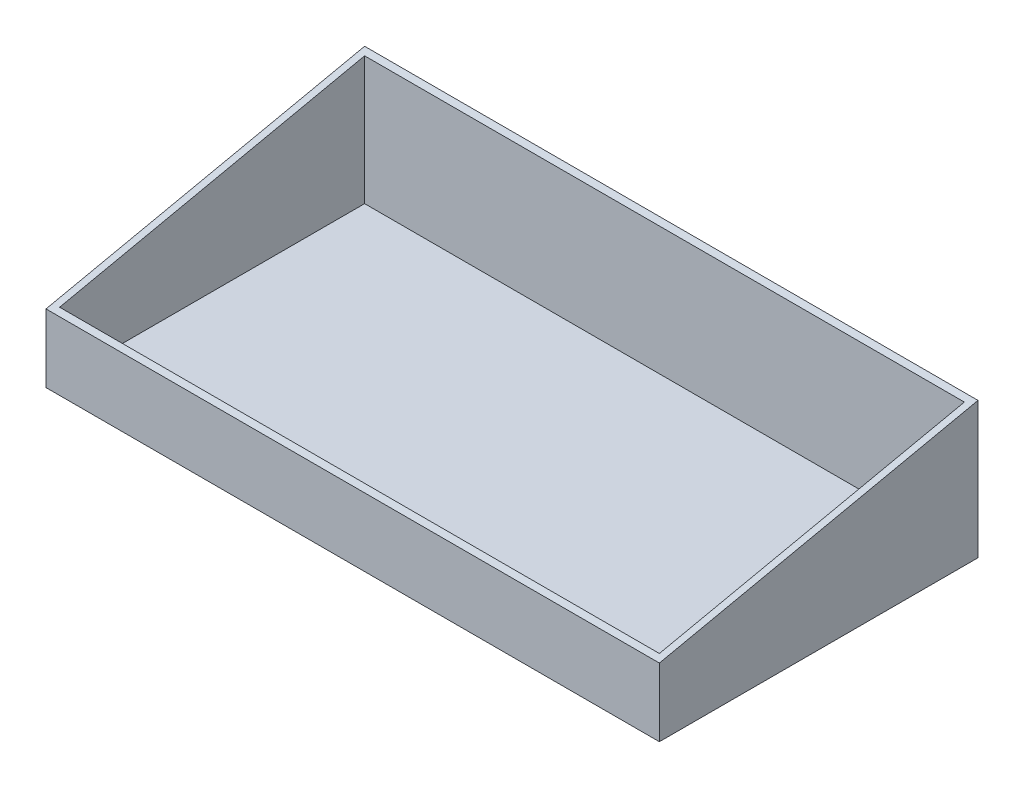
ISO-10303-21;
HEADER;
FILE_DESCRIPTION(('STEP AP214'),'2;1');
FILE_NAME('part.step','',(''),(''),'','','');
FILE_SCHEMA(('AUTOMOTIVE_DESIGN { 1 0 10303 214 1 1 1 1 }'));
ENDSEC;
DATA;
#1=APPLICATION_CONTEXT('core data for automotive mechanical design processes');
#2=APPLICATION_PROTOCOL_DEFINITION('international standard','automotive_design',2000,#1);
#3=PRODUCT_CONTEXT('',#1,'mechanical');
#4=PRODUCT('Part','Part','',(#3));
#5=PRODUCT_RELATED_PRODUCT_CATEGORY('part','',(#4));
#6=PRODUCT_DEFINITION_FORMATION('','',#4);
#7=PRODUCT_DEFINITION_CONTEXT('part definition',#1,'design');
#8=PRODUCT_DEFINITION('design','',#6,#7);
#9=PRODUCT_DEFINITION_SHAPE('','',#8);
#10=(LENGTH_UNIT() NAMED_UNIT(*) SI_UNIT(.MILLI.,.METRE.));
#11=(NAMED_UNIT(*) PLANE_ANGLE_UNIT() SI_UNIT($,.RADIAN.));
#12=(NAMED_UNIT(*) SI_UNIT($,.STERADIAN.) SOLID_ANGLE_UNIT());
#13=UNCERTAINTY_MEASURE_WITH_UNIT(LENGTH_MEASURE(1.E-05),#10,'distance_accuracy_value','');
#14=(GEOMETRIC_REPRESENTATION_CONTEXT(3) GLOBAL_UNCERTAINTY_ASSIGNED_CONTEXT((#13)) GLOBAL_UNIT_ASSIGNED_CONTEXT((#10,
#11,#12)) REPRESENTATION_CONTEXT('',''));
#15=CARTESIAN_POINT('',(0.,0.,0.));
#16=DIRECTION('',(0.,0.,1.));
#17=DIRECTION('',(1.,0.,0.));
#18=AXIS2_PLACEMENT_3D('',#15,#16,#17);
#19=CARTESIAN_POINT('',(180.,80.,-93.5));
#20=DIRECTION('',(-1.,0.,0.));
#21=DIRECTION('',(0.,0.,1.));
#22=AXIS2_PLACEMENT_3D('',#19,#20,#21);
#23=PLANE('',#22);
#24=DIRECTION('',(0.,-1.,0.));
#25=VECTOR('',#24,1.);
#26=CARTESIAN_POINT('',(180.,80.,-93.5));
#27=LINE('',#26,#25);
#28=CARTESIAN_POINT('',(180.,80.,-93.5));
#29=VERTEX_POINT('',#28);
#30=CARTESIAN_POINT('',(180.,0.,-93.5));
#31=VERTEX_POINT('',#30);
#32=EDGE_CURVE('E43',#29,#31,#27,.T.);
#33=ORIENTED_EDGE('',*,*,#32,.F.);
#34=DIRECTION('',(0.,-0.209171951911289,0.977878875185276));
#35=VECTOR('',#34,1.);
#36=CARTESIAN_POINT('',(180.,80.,-93.5000000000001));
#37=LINE('',#36,#35);
#38=CARTESIAN_POINT('',(180.,40.,93.4999999999999));
#39=VERTEX_POINT('',#38);
#40=EDGE_CURVE('E58',#29,#39,#37,.T.);
#41=ORIENTED_EDGE('',*,*,#40,.T.);
#42=DIRECTION('',(0.,-1.,0.));
#43=VECTOR('',#42,1.);
#44=CARTESIAN_POINT('',(180.,80.,93.5));
#45=LINE('',#44,#43);
#46=CARTESIAN_POINT('',(180.,0.,93.5));
#47=VERTEX_POINT('',#46);
#48=EDGE_CURVE('E89',#39,#47,#45,.T.);
#49=ORIENTED_EDGE('',*,*,#48,.T.);
#50=DIRECTION('',(0.,0.,-1.));
#51=VECTOR('',#50,1.);
#52=CARTESIAN_POINT('',(180.,0.,-93.5));
#53=LINE('',#52,#51);
#54=EDGE_CURVE('E101',#47,#31,#53,.T.);
#55=ORIENTED_EDGE('',*,*,#54,.T.);
#56=EDGE_LOOP('',(#33,#41,#49,#55));
#57=FACE_BOUND('',#56,.T.);
#58=ADVANCED_FACE('F36',(#57),#23,.F.);
#59=CARTESIAN_POINT('',(-180.,80.,-93.5));
#60=DIRECTION('',(0.,0.,1.));
#61=DIRECTION('',(1.,0.,0.));
#62=AXIS2_PLACEMENT_3D('',#59,#60,#61);
#63=PLANE('',#62);
#64=DIRECTION('',(-1.,0.,0.));
#65=VECTOR('',#64,1.);
#66=CARTESIAN_POINT('',(-180.,0.,-93.5));
#67=LINE('',#66,#65);
#68=CARTESIAN_POINT('',(-180.,0.,-93.5));
#69=VERTEX_POINT('',#68);
#70=EDGE_CURVE('E97',#31,#69,#67,.T.);
#71=ORIENTED_EDGE('',*,*,#70,.T.);
#72=DIRECTION('',(0.,-1.,0.));
#73=VECTOR('',#72,1.);
#74=CARTESIAN_POINT('',(-180.,80.,-93.5));
#75=LINE('',#74,#73);
#76=CARTESIAN_POINT('',(-180.,80.,-93.5));
#77=VERTEX_POINT('',#76);
#78=EDGE_CURVE('E88',#77,#69,#75,.T.);
#79=ORIENTED_EDGE('',*,*,#78,.F.);
#80=DIRECTION('',(-1.,0.,0.));
#81=VECTOR('',#80,1.);
#82=CARTESIAN_POINT('',(-180.,80.,-93.5));
#83=LINE('',#82,#81);
#84=EDGE_CURVE('E102',#29,#77,#83,.T.);
#85=ORIENTED_EDGE('',*,*,#84,.F.);
#86=ORIENTED_EDGE('',*,*,#32,.T.);
#87=EDGE_LOOP('',(#71,#79,#85,#86));
#88=FACE_BOUND('',#87,.T.);
#89=ADVANCED_FACE('F111',(#88),#63,.F.);
#90=CARTESIAN_POINT('',(-180.,80.,-93.5));
#91=DIRECTION('',(1.,0.,0.));
#92=DIRECTION('',(0.,0.,-1.));
#93=AXIS2_PLACEMENT_3D('',#90,#91,#92);
#94=PLANE('',#93);
#95=DIRECTION('',(0.,-1.,0.));
#96=VECTOR('',#95,1.);
#97=CARTESIAN_POINT('',(-180.,80.,93.5));
#98=LINE('',#97,#96);
#99=CARTESIAN_POINT('',(-180.,40.,93.5));
#100=VERTEX_POINT('',#99);
#101=CARTESIAN_POINT('',(-180.,0.,93.5));
#102=VERTEX_POINT('',#101);
#103=EDGE_CURVE('E77',#100,#102,#98,.T.);
#104=ORIENTED_EDGE('',*,*,#103,.F.);
#105=DIRECTION('',(0.,-0.209171951911289,0.977878875185276));
#106=VECTOR('',#105,1.);
#107=CARTESIAN_POINT('',(-180.,80.,-93.5));
#108=LINE('',#107,#106);
#109=EDGE_CURVE('E146',#77,#100,#108,.T.);
#110=ORIENTED_EDGE('',*,*,#109,.F.);
#111=ORIENTED_EDGE('',*,*,#78,.T.);
#112=DIRECTION('',(0.,0.,1.));
#113=VECTOR('',#112,1.);
#114=CARTESIAN_POINT('',(-180.,0.,-93.5));
#115=LINE('',#114,#113);
#116=EDGE_CURVE('E93',#69,#102,#115,.T.);
#117=ORIENTED_EDGE('',*,*,#116,.T.);
#118=EDGE_LOOP('',(#104,#110,#111,#117));
#119=FACE_BOUND('',#118,.T.);
#120=ADVANCED_FACE('F94',(#119),#94,.F.);
#121=CARTESIAN_POINT('',(-180.,80.,93.5));
#122=DIRECTION('',(0.,0.,-1.));
#123=DIRECTION('',(-1.,0.,0.));
#124=AXIS2_PLACEMENT_3D('',#121,#122,#123);
#125=PLANE('',#124);
#126=ORIENTED_EDGE('',*,*,#48,.F.);
#127=DIRECTION('',(-1.,0.,0.));
#128=VECTOR('',#127,1.);
#129=CARTESIAN_POINT('',(180.,40.,93.4999999999999));
#130=LINE('',#129,#128);
#131=EDGE_CURVE('E85',#39,#100,#130,.T.);
#132=ORIENTED_EDGE('',*,*,#131,.T.);
#133=ORIENTED_EDGE('',*,*,#103,.T.);
#134=DIRECTION('',(1.,0.,0.));
#135=VECTOR('',#134,1.);
#136=CARTESIAN_POINT('',(-180.,0.,93.5));
#137=LINE('',#136,#135);
#138=EDGE_CURVE('E82',#102,#47,#137,.T.);
#139=ORIENTED_EDGE('',*,*,#138,.T.);
#140=EDGE_LOOP('',(#126,#132,#133,#139));
#141=FACE_BOUND('',#140,.T.);
#142=ADVANCED_FACE('F80',(#141),#125,.F.);
#143=CARTESIAN_POINT('',(0.,0.,0.));
#144=DIRECTION('',(0.,1.,0.));
#145=DIRECTION('',(0.,0.,1.));
#146=AXIS2_PLACEMENT_3D('',#143,#144,#145);
#147=PLANE('',#146);
#148=ORIENTED_EDGE('',*,*,#54,.F.);
#149=ORIENTED_EDGE('',*,*,#138,.F.);
#150=ORIENTED_EDGE('',*,*,#116,.F.);
#151=ORIENTED_EDGE('',*,*,#70,.F.);
#152=EDGE_LOOP('',(#148,#149,#150,#151));
#153=FACE_BOUND('',#152,.T.);
#154=ADVANCED_FACE('F99',(#153),#147,.F.);
#155=CARTESIAN_POINT('',(180.,80.,-93.5000000000001));
#156=DIRECTION('',(0.,-0.977878875185276,-0.209171951911289));
#157=DIRECTION('',(0.,0.209171951911289,-0.977878875185276));
#158=AXIS2_PLACEMENT_3D('',#155,#156,#157);
#159=PLANE('',#158);
#160=DIRECTION('',(0.,-0.209171951911289,0.977878875185276));
#161=VECTOR('',#160,1.);
#162=CARTESIAN_POINT('',(176.,80.,-93.5));
#163=LINE('',#162,#161);
#164=CARTESIAN_POINT('',(176.,79.144385026738,-89.5));
#165=VERTEX_POINT('',#164);
#166=CARTESIAN_POINT('',(176.,40.855614973262,89.5));
#167=VERTEX_POINT('',#166);
#168=EDGE_CURVE('E49',#165,#167,#163,.T.);
#169=ORIENTED_EDGE('',*,*,#168,.T.);
#170=DIRECTION('',(-1.,0.,0.));
#171=VECTOR('',#170,1.);
#172=CARTESIAN_POINT('',(-180.,40.855614973262,89.5));
#173=LINE('',#172,#171);
#174=CARTESIAN_POINT('',(-176.,40.855614973262,89.5));
#175=VERTEX_POINT('',#174);
#176=EDGE_CURVE('E11',#167,#175,#173,.T.);
#177=ORIENTED_EDGE('',*,*,#176,.T.);
#178=DIRECTION('',(0.,0.209171951911289,-0.977878875185276));
#179=VECTOR('',#178,1.);
#180=CARTESIAN_POINT('',(-176.,80.,-93.5));
#181=LINE('',#180,#179);
#182=CARTESIAN_POINT('',(-176.,79.144385026738,-89.5));
#183=VERTEX_POINT('',#182);
#184=EDGE_CURVE('E142',#175,#183,#181,.T.);
#185=ORIENTED_EDGE('',*,*,#184,.T.);
#186=DIRECTION('',(1.,0.,0.));
#187=VECTOR('',#186,1.);
#188=CARTESIAN_POINT('',(-180.,79.144385026738,-89.5));
#189=LINE('',#188,#187);
#190=EDGE_CURVE('E140',#183,#165,#189,.T.);
#191=ORIENTED_EDGE('',*,*,#190,.T.);
#192=EDGE_LOOP('',(#169,#177,#185,#191));
#193=FACE_BOUND('',#192,.T.);
#194=ORIENTED_EDGE('',*,*,#109,.T.);
#195=ORIENTED_EDGE('',*,*,#131,.F.);
#196=ORIENTED_EDGE('',*,*,#40,.F.);
#197=ORIENTED_EDGE('',*,*,#84,.T.);
#198=EDGE_LOOP('',(#194,#195,#196,#197));
#199=FACE_BOUND('',#198,.T.);
#200=ADVANCED_FACE('F185',(#193,#199),#159,.F.);
#201=CARTESIAN_POINT('',(0.,4.,0.));
#202=DIRECTION('',(0.,1.,0.));
#203=DIRECTION('',(0.,0.,1.));
#204=AXIS2_PLACEMENT_3D('',#201,#202,#203);
#205=PLANE('',#204);
#206=DIRECTION('',(0.,0.,-1.));
#207=VECTOR('',#206,1.);
#208=CARTESIAN_POINT('',(176.,4.,-93.5));
#209=LINE('',#208,#207);
#210=CARTESIAN_POINT('',(176.,4.,89.5));
#211=VERTEX_POINT('',#210);
#212=CARTESIAN_POINT('',(176.,4.,-89.5));
#213=VERTEX_POINT('',#212);
#214=EDGE_CURVE('E134',#211,#213,#209,.T.);
#215=ORIENTED_EDGE('',*,*,#214,.T.);
#216=DIRECTION('',(-1.,0.,0.));
#217=VECTOR('',#216,1.);
#218=CARTESIAN_POINT('',(-180.,4.,-89.5));
#219=LINE('',#218,#217);
#220=CARTESIAN_POINT('',(-176.,4.,-89.5));
#221=VERTEX_POINT('',#220);
#222=EDGE_CURVE('E129',#213,#221,#219,.T.);
#223=ORIENTED_EDGE('',*,*,#222,.T.);
#224=DIRECTION('',(0.,0.,1.));
#225=VECTOR('',#224,1.);
#226=CARTESIAN_POINT('',(-176.,4.,-93.5));
#227=LINE('',#226,#225);
#228=CARTESIAN_POINT('',(-176.,4.,89.5));
#229=VERTEX_POINT('',#228);
#230=EDGE_CURVE('E123',#221,#229,#227,.T.);
#231=ORIENTED_EDGE('',*,*,#230,.T.);
#232=DIRECTION('',(1.,0.,0.));
#233=VECTOR('',#232,1.);
#234=CARTESIAN_POINT('',(-180.,4.,89.5));
#235=LINE('',#234,#233);
#236=EDGE_CURVE('E119',#229,#211,#235,.T.);
#237=ORIENTED_EDGE('',*,*,#236,.T.);
#238=EDGE_LOOP('',(#215,#223,#231,#237));
#239=FACE_BOUND('',#238,.T.);
#240=ADVANCED_FACE('F176',(#239),#205,.T.);
#241=CARTESIAN_POINT('',(-180.,80.,89.5));
#242=DIRECTION('',(0.,0.,-1.));
#243=DIRECTION('',(-1.,0.,0.));
#244=AXIS2_PLACEMENT_3D('',#241,#242,#243);
#245=PLANE('',#244);
#246=ORIENTED_EDGE('',*,*,#176,.F.);
#247=DIRECTION('',(0.,-1.,0.));
#248=VECTOR('',#247,1.);
#249=CARTESIAN_POINT('',(176.,80.,89.5));
#250=LINE('',#249,#248);
#251=EDGE_CURVE('E122',#167,#211,#250,.T.);
#252=ORIENTED_EDGE('',*,*,#251,.T.);
#253=ORIENTED_EDGE('',*,*,#236,.F.);
#254=DIRECTION('',(0.,-1.,0.));
#255=VECTOR('',#254,1.);
#256=CARTESIAN_POINT('',(-176.,80.,89.5));
#257=LINE('',#256,#255);
#258=EDGE_CURVE('E124',#175,#229,#257,.T.);
#259=ORIENTED_EDGE('',*,*,#258,.F.);
#260=EDGE_LOOP('',(#246,#252,#253,#259));
#261=FACE_BOUND('',#260,.T.);
#262=ADVANCED_FACE('F172',(#261),#245,.T.);
#263=CARTESIAN_POINT('',(-176.,80.,-93.5));
#264=DIRECTION('',(1.,0.,0.));
#265=DIRECTION('',(0.,0.,-1.));
#266=AXIS2_PLACEMENT_3D('',#263,#264,#265);
#267=PLANE('',#266);
#268=ORIENTED_EDGE('',*,*,#184,.F.);
#269=ORIENTED_EDGE('',*,*,#258,.T.);
#270=ORIENTED_EDGE('',*,*,#230,.F.);
#271=DIRECTION('',(0.,-1.,0.));
#272=VECTOR('',#271,1.);
#273=CARTESIAN_POINT('',(-176.,80.,-89.5));
#274=LINE('',#273,#272);
#275=EDGE_CURVE('E116',#183,#221,#274,.T.);
#276=ORIENTED_EDGE('',*,*,#275,.F.);
#277=EDGE_LOOP('',(#268,#269,#270,#276));
#278=FACE_BOUND('',#277,.T.);
#279=ADVANCED_FACE('F184',(#278),#267,.T.);
#280=CARTESIAN_POINT('',(-180.,80.,-89.5));
#281=DIRECTION('',(0.,0.,1.));
#282=DIRECTION('',(1.,0.,0.));
#283=AXIS2_PLACEMENT_3D('',#280,#281,#282);
#284=PLANE('',#283);
#285=ORIENTED_EDGE('',*,*,#190,.F.);
#286=ORIENTED_EDGE('',*,*,#275,.T.);
#287=ORIENTED_EDGE('',*,*,#222,.F.);
#288=DIRECTION('',(0.,-1.,0.));
#289=VECTOR('',#288,1.);
#290=CARTESIAN_POINT('',(176.,80.,-89.5));
#291=LINE('',#290,#289);
#292=EDGE_CURVE('E113',#165,#213,#291,.T.);
#293=ORIENTED_EDGE('',*,*,#292,.F.);
#294=EDGE_LOOP('',(#285,#286,#287,#293));
#295=FACE_BOUND('',#294,.T.);
#296=ADVANCED_FACE('F182',(#295),#284,.T.);
#297=CARTESIAN_POINT('',(176.,80.,-93.5));
#298=DIRECTION('',(-1.,0.,0.));
#299=DIRECTION('',(0.,0.,1.));
#300=AXIS2_PLACEMENT_3D('',#297,#298,#299);
#301=PLANE('',#300);
#302=ORIENTED_EDGE('',*,*,#168,.F.);
#303=ORIENTED_EDGE('',*,*,#292,.T.);
#304=ORIENTED_EDGE('',*,*,#214,.F.);
#305=ORIENTED_EDGE('',*,*,#251,.F.);
#306=EDGE_LOOP('',(#302,#303,#304,#305));
#307=FACE_BOUND('',#306,.T.);
#308=ADVANCED_FACE('F177',(#307),#301,.T.);
#309=CLOSED_SHELL('',(#58,#89,#120,#142,#154,#200,#240,#262,#279,#296,#308));
#310=MANIFOLD_SOLID_BREP('B2',#309);
#311=ADVANCED_BREP_SHAPE_REPRESENTATION('',(#18,#310),#14);
#312=SHAPE_DEFINITION_REPRESENTATION(#9,#311);
ENDSEC;
END-ISO-10303-21;
